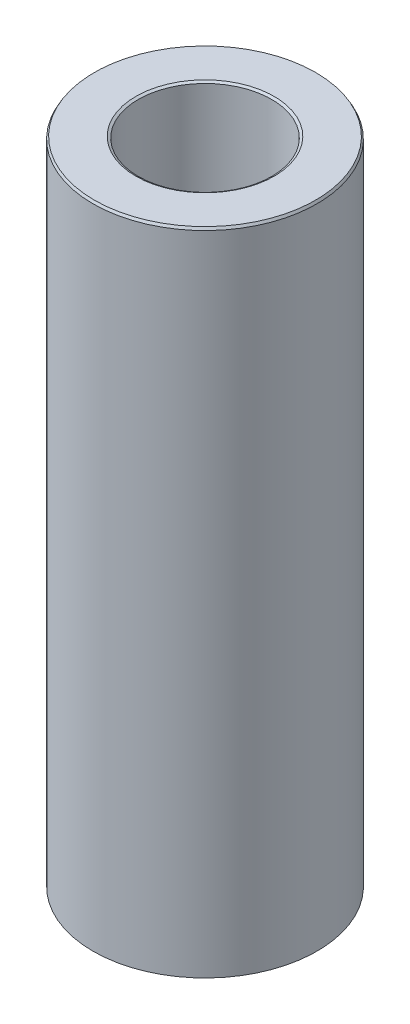
ISO-10303-21;
HEADER;
FILE_DESCRIPTION(('STEP AP214'),'2;1');
FILE_NAME('part.step','',(''),(''),'','','');
FILE_SCHEMA(('AUTOMOTIVE_DESIGN { 1 0 10303 214 1 1 1 1 }'));
ENDSEC;
DATA;
#1=APPLICATION_CONTEXT('core data for automotive mechanical design processes');
#2=APPLICATION_PROTOCOL_DEFINITION('international standard','automotive_design',2000,#1);
#3=PRODUCT_CONTEXT('',#1,'mechanical');
#4=PRODUCT('Part','Part','',(#3));
#5=PRODUCT_RELATED_PRODUCT_CATEGORY('part','',(#4));
#6=PRODUCT_DEFINITION_FORMATION('','',#4);
#7=PRODUCT_DEFINITION_CONTEXT('part definition',#1,'design');
#8=PRODUCT_DEFINITION('design','',#6,#7);
#9=PRODUCT_DEFINITION_SHAPE('','',#8);
#10=(LENGTH_UNIT() NAMED_UNIT(*) SI_UNIT(.MILLI.,.METRE.));
#11=(NAMED_UNIT(*) PLANE_ANGLE_UNIT() SI_UNIT($,.RADIAN.));
#12=(NAMED_UNIT(*) SI_UNIT($,.STERADIAN.) SOLID_ANGLE_UNIT());
#13=UNCERTAINTY_MEASURE_WITH_UNIT(LENGTH_MEASURE(1.E-05),#10,'distance_accuracy_value','');
#14=(GEOMETRIC_REPRESENTATION_CONTEXT(3) GLOBAL_UNCERTAINTY_ASSIGNED_CONTEXT((#13)) GLOBAL_UNIT_ASSIGNED_CONTEXT((#10,
#11,#12)) REPRESENTATION_CONTEXT('',''));
#15=CARTESIAN_POINT('',(0.,0.,0.));
#16=DIRECTION('',(0.,0.,1.));
#17=DIRECTION('',(1.,0.,0.));
#18=AXIS2_PLACEMENT_3D('',#15,#16,#17);
#19=CARTESIAN_POINT('',(0.,334.200777144962,0.));
#20=DIRECTION('',(0.,-1.,0.));
#21=DIRECTION('',(0.,0.,-1.));
#22=AXIS2_PLACEMENT_3D('',#19,#20,#21);
#23=CYLINDRICAL_SURFACE('',#22,57.5);
#24=CARTESIAN_POINT('',(0.,0.722199639562382,0.));
#25=DIRECTION('',(0.,1.,0.));
#26=DIRECTION('',(0.,0.,1.));
#27=AXIS2_PLACEMENT_3D('',#24,#25,#26);
#28=CIRCLE('',#27,57.5);
#29=CARTESIAN_POINT('',(0.,0.722199639562382,57.5));
#30=VERTEX_POINT('',#29);
#31=EDGE_CURVE('E10',#30,#30,#28,.T.);
#32=ORIENTED_EDGE('',*,*,#31,.T.);
#33=EDGE_LOOP('',(#32));
#34=FACE_BOUND('',#33,.T.);
#35=CARTESIAN_POINT('',(0.,332.949890676032,0.));
#36=DIRECTION('',(0.,1.,0.));
#37=DIRECTION('',(0.,0.,1.));
#38=AXIS2_PLACEMENT_3D('',#35,#36,#37);
#39=CIRCLE('',#38,57.5);
#40=CARTESIAN_POINT('',(0.,332.949890676032,57.5));
#41=VERTEX_POINT('',#40);
#42=EDGE_CURVE('E50',#41,#41,#39,.F.);
#43=ORIENTED_EDGE('',*,*,#42,.T.);
#44=EDGE_LOOP('',(#43));
#45=FACE_BOUND('',#44,.T.);
#46=ADVANCED_FACE('F39',(#34,#45),#23,.T.);
#47=CARTESIAN_POINT('',(0.,334.200777144962,0.));
#48=DIRECTION('',(0.,1.,0.));
#49=DIRECTION('',(0.,0.,1.));
#50=AXIS2_PLACEMENT_3D('',#47,#48,#49);
#51=PLANE('',#50);
#52=CARTESIAN_POINT('',(0.,334.200777144962,0.));
#53=DIRECTION('',(0.,1.,0.));
#54=DIRECTION('',(0.,0.,1.));
#55=AXIS2_PLACEMENT_3D('',#52,#53,#54);
#56=CIRCLE('',#55,35.4996768378047);
#57=CARTESIAN_POINT('',(0.,334.200777144962,35.4996768378047));
#58=VERTEX_POINT('',#57);
#59=EDGE_CURVE('E58',#58,#58,#56,.F.);
#60=ORIENTED_EDGE('',*,*,#59,.T.);
#61=EDGE_LOOP('',(#60));
#62=FACE_BOUND('',#61,.T.);
#63=CARTESIAN_POINT('',(0.,334.200777144962,0.));
#64=DIRECTION('',(0.,1.,0.));
#65=DIRECTION('',(0.,0.,1.));
#66=AXIS2_PLACEMENT_3D('',#63,#64,#65);
#67=CIRCLE('',#66,56.7778003604376);
#68=CARTESIAN_POINT('',(0.,334.200777144962,56.7778003604376));
#69=VERTEX_POINT('',#68);
#70=EDGE_CURVE('E61',#69,#69,#67,.T.);
#71=ORIENTED_EDGE('',*,*,#70,.T.);
#72=EDGE_LOOP('',(#71));
#73=FACE_BOUND('',#72,.T.);
#74=ADVANCED_FACE('F88',(#62,#73),#51,.T.);
#75=CARTESIAN_POINT('',(0.,0.,0.));
#76=DIRECTION('',(0.,1.,0.));
#77=DIRECTION('',(0.,0.,1.));
#78=AXIS2_PLACEMENT_3D('',#75,#76,#77);
#79=PLANE('',#78);
#80=CARTESIAN_POINT('',(0.,0.,0.));
#81=DIRECTION('',(0.,1.,0.));
#82=DIRECTION('',(0.,0.,1.));
#83=AXIS2_PLACEMENT_3D('',#80,#81,#82);
#84=CIRCLE('',#83,34.9709900084372);
#85=CARTESIAN_POINT('',(0.,0.,34.9709900084372));
#86=VERTEX_POINT('',#85);
#87=EDGE_CURVE('E51',#86,#86,#84,.T.);
#88=ORIENTED_EDGE('',*,*,#87,.T.);
#89=EDGE_LOOP('',(#88));
#90=FACE_BOUND('',#89,.T.);
#91=CARTESIAN_POINT('',(0.,0.,0.));
#92=DIRECTION('',(0.,1.,0.));
#93=DIRECTION('',(0.,0.,1.));
#94=AXIS2_PLACEMENT_3D('',#91,#92,#93);
#95=CIRCLE('',#94,56.24911353107);
#96=CARTESIAN_POINT('',(0.,0.,56.24911353107));
#97=VERTEX_POINT('',#96);
#98=EDGE_CURVE('E54',#97,#97,#95,.F.);
#99=ORIENTED_EDGE('',*,*,#98,.T.);
#100=EDGE_LOOP('',(#99));
#101=FACE_BOUND('',#100,.T.);
#102=ADVANCED_FACE('F83',(#90,#101),#79,.F.);
#103=CARTESIAN_POINT('',(0.,334.200777144962,0.));
#104=DIRECTION('',(0.,-1.,0.));
#105=DIRECTION('',(0.,0.,-1.));
#106=AXIS2_PLACEMENT_3D('',#103,#104,#105);
#107=CYLINDRICAL_SURFACE('',#106,34.2487903688749);
#108=CARTESIAN_POINT('',(0.,333.4785775054,0.));
#109=DIRECTION('',(0.,1.,0.));
#110=DIRECTION('',(0.,0.,1.));
#111=AXIS2_PLACEMENT_3D('',#108,#109,#110);
#112=CIRCLE('',#111,34.2487903688749);
#113=CARTESIAN_POINT('',(0.,333.4785775054,34.2487903688749));
#114=VERTEX_POINT('',#113);
#115=EDGE_CURVE('E67',#114,#114,#112,.T.);
#116=ORIENTED_EDGE('',*,*,#115,.T.);
#117=EDGE_LOOP('',(#116));
#118=FACE_BOUND('',#117,.T.);
#119=CARTESIAN_POINT('',(0.,1.2508864689299,0.));
#120=DIRECTION('',(0.,1.,0.));
#121=DIRECTION('',(0.,0.,1.));
#122=AXIS2_PLACEMENT_3D('',#119,#120,#121);
#123=CIRCLE('',#122,34.2487903688749);
#124=CARTESIAN_POINT('',(0.,1.2508864689299,34.2487903688749));
#125=VERTEX_POINT('',#124);
#126=EDGE_CURVE('E69',#125,#125,#123,.F.);
#127=ORIENTED_EDGE('',*,*,#126,.T.);
#128=EDGE_LOOP('',(#127));
#129=FACE_BOUND('',#128,.T.);
#130=ADVANCED_FACE('F71',(#118,#129),#107,.F.);
#131=CARTESIAN_POINT('',(0.,333.4785775054,0.));
#132=DIRECTION('',(0.,1.,0.));
#133=DIRECTION('',(0.,0.,1.));
#134=AXIS2_PLACEMENT_3D('',#131,#132,#133);
#135=CONICAL_SURFACE('',#134,34.2487903688749,1.0471975511966);
#136=ORIENTED_EDGE('',*,*,#59,.F.);
#137=EDGE_LOOP('',(#136));
#138=FACE_BOUND('',#137,.T.);
#139=ORIENTED_EDGE('',*,*,#115,.F.);
#140=EDGE_LOOP('',(#139));
#141=FACE_BOUND('',#140,.T.);
#142=ADVANCED_FACE('F77',(#138,#141),#135,.F.);
#143=CARTESIAN_POINT('',(0.,0.,0.));
#144=DIRECTION('',(0.,-1.,0.));
#145=DIRECTION('',(0.,0.,-1.));
#146=AXIS2_PLACEMENT_3D('',#143,#144,#145);
#147=CONICAL_SURFACE('',#146,34.9709900084372,0.523598775598275);
#148=ORIENTED_EDGE('',*,*,#126,.F.);
#149=EDGE_LOOP('',(#148));
#150=FACE_BOUND('',#149,.T.);
#151=ORIENTED_EDGE('',*,*,#87,.F.);
#152=EDGE_LOOP('',(#151));
#153=FACE_BOUND('',#152,.T.);
#154=ADVANCED_FACE('F73',(#150,#153),#147,.F.);
#155=CARTESIAN_POINT('',(0.,0.722199639562382,0.));
#156=DIRECTION('',(0.,1.,0.));
#157=DIRECTION('',(0.,0.,1.));
#158=AXIS2_PLACEMENT_3D('',#155,#156,#157);
#159=CONICAL_SURFACE('',#158,57.5,1.0471975511966);
#160=ORIENTED_EDGE('',*,*,#98,.F.);
#161=EDGE_LOOP('',(#160));
#162=FACE_BOUND('',#161,.T.);
#163=ORIENTED_EDGE('',*,*,#31,.F.);
#164=EDGE_LOOP('',(#163));
#165=FACE_BOUND('',#164,.T.);
#166=ADVANCED_FACE('F76',(#162,#165),#159,.T.);
#167=CARTESIAN_POINT('',(0.,334.200777144962,0.));
#168=DIRECTION('',(0.,-1.,0.));
#169=DIRECTION('',(0.,0.,-1.));
#170=AXIS2_PLACEMENT_3D('',#167,#168,#169);
#171=CONICAL_SURFACE('',#170,56.7778003604376,0.523598775598293);
#172=ORIENTED_EDGE('',*,*,#42,.F.);
#173=EDGE_LOOP('',(#172));
#174=FACE_BOUND('',#173,.T.);
#175=ORIENTED_EDGE('',*,*,#70,.F.);
#176=EDGE_LOOP('',(#175));
#177=FACE_BOUND('',#176,.T.);
#178=ADVANCED_FACE('F45',(#174,#177),#171,.T.);
#179=CLOSED_SHELL('',(#46,#74,#102,#130,#142,#154,#166,#178));
#180=MANIFOLD_SOLID_BREP('B2',#179);
#181=ADVANCED_BREP_SHAPE_REPRESENTATION('',(#18,#180),#14);
#182=SHAPE_DEFINITION_REPRESENTATION(#9,#181);
ENDSEC;
END-ISO-10303-21;
